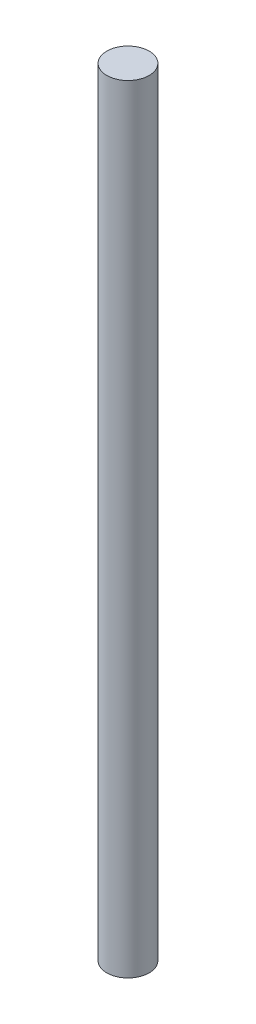
ISO-10303-21;
HEADER;
FILE_DESCRIPTION(('STEP AP214'),'2;1');
FILE_NAME('part.step','',(''),(''),'','','');
FILE_SCHEMA(('AUTOMOTIVE_DESIGN { 1 0 10303 214 1 1 1 1 }'));
ENDSEC;
DATA;
#1=APPLICATION_CONTEXT('core data for automotive mechanical design processes');
#2=APPLICATION_PROTOCOL_DEFINITION('international standard','automotive_design',2000,#1);
#3=PRODUCT_CONTEXT('',#1,'mechanical');
#4=PRODUCT('Part','Part','',(#3));
#5=PRODUCT_RELATED_PRODUCT_CATEGORY('part','',(#4));
#6=PRODUCT_DEFINITION_FORMATION('','',#4);
#7=PRODUCT_DEFINITION_CONTEXT('part definition',#1,'design');
#8=PRODUCT_DEFINITION('design','',#6,#7);
#9=PRODUCT_DEFINITION_SHAPE('','',#8);
#10=(LENGTH_UNIT() NAMED_UNIT(*) SI_UNIT(.MILLI.,.METRE.));
#11=(NAMED_UNIT(*) PLANE_ANGLE_UNIT() SI_UNIT($,.RADIAN.));
#12=(NAMED_UNIT(*) SI_UNIT($,.STERADIAN.) SOLID_ANGLE_UNIT());
#13=UNCERTAINTY_MEASURE_WITH_UNIT(LENGTH_MEASURE(1.E-05),#10,'distance_accuracy_value','');
#14=(GEOMETRIC_REPRESENTATION_CONTEXT(3) GLOBAL_UNCERTAINTY_ASSIGNED_CONTEXT((#13)) GLOBAL_UNIT_ASSIGNED_CONTEXT((#10,
#11,#12)) REPRESENTATION_CONTEXT('',''));
#15=CARTESIAN_POINT('',(0.,0.,0.));
#16=DIRECTION('',(0.,0.,1.));
#17=DIRECTION('',(1.,0.,0.));
#18=AXIS2_PLACEMENT_3D('',#15,#16,#17);
#19=CARTESIAN_POINT('',(0.,350.,0.));
#20=DIRECTION('',(0.,-1.,0.));
#21=DIRECTION('',(0.,0.,-1.));
#22=AXIS2_PLACEMENT_3D('',#19,#20,#21);
#23=CYLINDRICAL_SURFACE('',#22,9.525);
#24=CARTESIAN_POINT('',(0.,350.,0.));
#25=DIRECTION('',(0.,1.,0.));
#26=DIRECTION('',(0.,0.,1.));
#27=AXIS2_PLACEMENT_3D('',#24,#25,#26);
#28=CIRCLE('',#27,9.525);
#29=CARTESIAN_POINT('',(0.,350.,9.525));
#30=VERTEX_POINT('',#29);
#31=EDGE_CURVE('E10',#30,#30,#28,.T.);
#32=ORIENTED_EDGE('',*,*,#31,.F.);
#33=EDGE_LOOP('',(#32));
#34=FACE_BOUND('',#33,.T.);
#35=CARTESIAN_POINT('',(0.,0.,0.));
#36=DIRECTION('',(0.,1.,0.));
#37=DIRECTION('',(0.,0.,1.));
#38=AXIS2_PLACEMENT_3D('',#35,#36,#37);
#39=CIRCLE('',#38,9.525);
#40=CARTESIAN_POINT('',(0.,0.,9.525));
#41=VERTEX_POINT('',#40);
#42=EDGE_CURVE('E40',#41,#41,#39,.T.);
#43=ORIENTED_EDGE('',*,*,#42,.T.);
#44=EDGE_LOOP('',(#43));
#45=FACE_BOUND('',#44,.T.);
#46=ADVANCED_FACE('F37',(#34,#45),#23,.T.);
#47=CARTESIAN_POINT('',(0.,350.,0.));
#48=DIRECTION('',(0.,1.,0.));
#49=DIRECTION('',(0.,0.,1.));
#50=AXIS2_PLACEMENT_3D('',#47,#48,#49);
#51=PLANE('',#50);
#52=ORIENTED_EDGE('',*,*,#31,.T.);
#53=EDGE_LOOP('',(#52));
#54=FACE_BOUND('',#53,.T.);
#55=ADVANCED_FACE('F54',(#54),#51,.T.);
#56=CARTESIAN_POINT('',(0.,0.,0.));
#57=DIRECTION('',(0.,1.,0.));
#58=DIRECTION('',(0.,0.,1.));
#59=AXIS2_PLACEMENT_3D('',#56,#57,#58);
#60=PLANE('',#59);
#61=ORIENTED_EDGE('',*,*,#42,.F.);
#62=EDGE_LOOP('',(#61));
#63=FACE_BOUND('',#62,.T.);
#64=ADVANCED_FACE('F52',(#63),#60,.F.);
#65=CLOSED_SHELL('',(#46,#55,#64));
#66=MANIFOLD_SOLID_BREP('B2',#65);
#67=ADVANCED_BREP_SHAPE_REPRESENTATION('',(#18,#66),#14);
#68=SHAPE_DEFINITION_REPRESENTATION(#9,#67);
ENDSEC;
END-ISO-10303-21;
